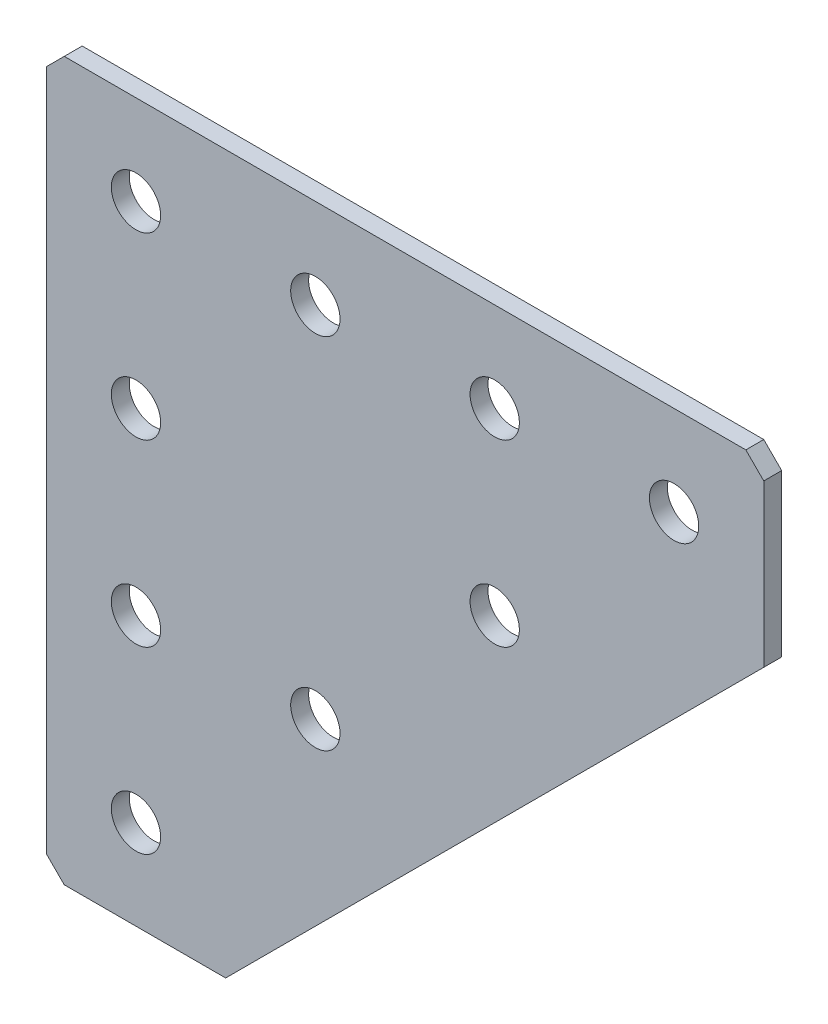
ISO-10303-21;
HEADER;
FILE_DESCRIPTION(('STEP AP214'),'2;1');
FILE_NAME('part.step','',(''),(''),'','','');
FILE_SCHEMA(('AUTOMOTIVE_DESIGN { 1 0 10303 214 1 1 1 1 }'));
ENDSEC;
DATA;
#1=APPLICATION_CONTEXT('core data for automotive mechanical design processes');
#2=APPLICATION_PROTOCOL_DEFINITION('international standard','automotive_design',2000,#1);
#3=PRODUCT_CONTEXT('',#1,'mechanical');
#4=PRODUCT('Part','Part','',(#3));
#5=PRODUCT_RELATED_PRODUCT_CATEGORY('part','',(#4));
#6=PRODUCT_DEFINITION_FORMATION('','',#4);
#7=PRODUCT_DEFINITION_CONTEXT('part definition',#1,'design');
#8=PRODUCT_DEFINITION('design','',#6,#7);
#9=PRODUCT_DEFINITION_SHAPE('','',#8);
#10=(LENGTH_UNIT() NAMED_UNIT(*) SI_UNIT(.MILLI.,.METRE.));
#11=(NAMED_UNIT(*) PLANE_ANGLE_UNIT() SI_UNIT($,.RADIAN.));
#12=(NAMED_UNIT(*) SI_UNIT($,.STERADIAN.) SOLID_ANGLE_UNIT());
#13=UNCERTAINTY_MEASURE_WITH_UNIT(LENGTH_MEASURE(1.E-05),#10,'distance_accuracy_value','');
#14=(GEOMETRIC_REPRESENTATION_CONTEXT(3) GLOBAL_UNCERTAINTY_ASSIGNED_CONTEXT((#13)) GLOBAL_UNIT_ASSIGNED_CONTEXT((#10,
#11,#12)) REPRESENTATION_CONTEXT('',''));
#15=CARTESIAN_POINT('',(0.,0.,0.));
#16=DIRECTION('',(0.,0.,1.));
#17=DIRECTION('',(1.,0.,0.));
#18=AXIS2_PLACEMENT_3D('',#15,#16,#17);
#19=CARTESIAN_POINT('',(0.,0.,-2.));
#20=DIRECTION('',(0.,-1.,0.));
#21=DIRECTION('',(0.,0.,-1.));
#22=AXIS2_PLACEMENT_3D('',#19,#20,#21);
#23=PLANE('',#22);
#24=DIRECTION('',(1.,0.,0.));
#25=VECTOR('',#24,1.);
#26=CARTESIAN_POINT('',(0.,0.,0.));
#27=LINE('',#26,#25);
#28=CARTESIAN_POINT('',(2.00000000000002,0.,0.));
#29=VERTEX_POINT('',#28);
#30=CARTESIAN_POINT('',(20.,0.,0.));
#31=VERTEX_POINT('',#30);
#32=EDGE_CURVE('E148',#29,#31,#27,.T.);
#33=ORIENTED_EDGE('',*,*,#32,.F.);
#34=DIRECTION('',(0.,0.,-1.));
#35=VECTOR('',#34,1.);
#36=CARTESIAN_POINT('',(2.00000000000002,0.,-2.));
#37=LINE('',#36,#35);
#38=CARTESIAN_POINT('',(2.00000000000002,0.,-2.));
#39=VERTEX_POINT('',#38);
#40=EDGE_CURVE('E117',#29,#39,#37,.T.);
#41=ORIENTED_EDGE('',*,*,#40,.T.);
#42=DIRECTION('',(1.,0.,0.));
#43=VECTOR('',#42,1.);
#44=CARTESIAN_POINT('',(0.,0.,-2.));
#45=LINE('',#44,#43);
#46=CARTESIAN_POINT('',(20.,0.,-2.));
#47=VERTEX_POINT('',#46);
#48=EDGE_CURVE('E111',#39,#47,#45,.T.);
#49=ORIENTED_EDGE('',*,*,#48,.T.);
#50=DIRECTION('',(0.,0.,1.));
#51=VECTOR('',#50,1.);
#52=CARTESIAN_POINT('',(20.,0.,-2.));
#53=LINE('',#52,#51);
#54=EDGE_CURVE('E114',#47,#31,#53,.T.);
#55=ORIENTED_EDGE('',*,*,#54,.T.);
#56=EDGE_LOOP('',(#33,#41,#49,#55));
#57=FACE_BOUND('',#56,.T.);
#58=ADVANCED_FACE('F43',(#57),#23,.T.);
#59=CARTESIAN_POINT('',(0.,0.,-2.));
#60=DIRECTION('',(-1.,0.,0.));
#61=DIRECTION('',(0.,0.,1.));
#62=AXIS2_PLACEMENT_3D('',#59,#60,#61);
#63=PLANE('',#62);
#64=DIRECTION('',(0.,-1.,0.));
#65=VECTOR('',#64,1.);
#66=CARTESIAN_POINT('',(0.,0.,-2.));
#67=LINE('',#66,#65);
#68=CARTESIAN_POINT('',(0.,78.,-2.));
#69=VERTEX_POINT('',#68);
#70=CARTESIAN_POINT('',(0.,2.,-2.));
#71=VERTEX_POINT('',#70);
#72=EDGE_CURVE('E131',#69,#71,#67,.T.);
#73=ORIENTED_EDGE('',*,*,#72,.T.);
#74=DIRECTION('',(0.,0.,1.));
#75=VECTOR('',#74,1.);
#76=CARTESIAN_POINT('',(0.,2.,-2.));
#77=LINE('',#76,#75);
#78=CARTESIAN_POINT('',(0.,2.,0.));
#79=VERTEX_POINT('',#78);
#80=EDGE_CURVE('E176',#71,#79,#77,.T.);
#81=ORIENTED_EDGE('',*,*,#80,.T.);
#82=DIRECTION('',(0.,-1.,0.));
#83=VECTOR('',#82,1.);
#84=CARTESIAN_POINT('',(0.,0.,0.));
#85=LINE('',#84,#83);
#86=CARTESIAN_POINT('',(0.,78.,0.));
#87=VERTEX_POINT('',#86);
#88=EDGE_CURVE('E122',#87,#79,#85,.T.);
#89=ORIENTED_EDGE('',*,*,#88,.F.);
#90=DIRECTION('',(0.,0.,-1.));
#91=VECTOR('',#90,1.);
#92=CARTESIAN_POINT('',(0.,78.,-2.));
#93=LINE('',#92,#91);
#94=EDGE_CURVE('E166',#87,#69,#93,.T.);
#95=ORIENTED_EDGE('',*,*,#94,.T.);
#96=EDGE_LOOP('',(#73,#81,#89,#95));
#97=FACE_BOUND('',#96,.T.);
#98=ADVANCED_FACE('F221',(#97),#63,.T.);
#99=CARTESIAN_POINT('',(0.,80.,-2.));
#100=DIRECTION('',(0.,1.,0.));
#101=DIRECTION('',(0.,0.,1.));
#102=AXIS2_PLACEMENT_3D('',#99,#100,#101);
#103=PLANE('',#102);
#104=DIRECTION('',(-1.,0.,0.));
#105=VECTOR('',#104,1.);
#106=CARTESIAN_POINT('',(0.,80.,-2.));
#107=LINE('',#106,#105);
#108=CARTESIAN_POINT('',(78.,80.,-2.));
#109=VERTEX_POINT('',#108);
#110=CARTESIAN_POINT('',(2.,80.,-2.));
#111=VERTEX_POINT('',#110);
#112=EDGE_CURVE('E139',#109,#111,#107,.T.);
#113=ORIENTED_EDGE('',*,*,#112,.T.);
#114=DIRECTION('',(0.,0.,1.));
#115=VECTOR('',#114,1.);
#116=CARTESIAN_POINT('',(2.,80.,-2.));
#117=LINE('',#116,#115);
#118=CARTESIAN_POINT('',(2.,80.,0.));
#119=VERTEX_POINT('',#118);
#120=EDGE_CURVE('E52',#111,#119,#117,.T.);
#121=ORIENTED_EDGE('',*,*,#120,.T.);
#122=DIRECTION('',(-1.,0.,0.));
#123=VECTOR('',#122,1.);
#124=CARTESIAN_POINT('',(0.,80.,0.));
#125=LINE('',#124,#123);
#126=CARTESIAN_POINT('',(78.,80.,0.));
#127=VERTEX_POINT('',#126);
#128=EDGE_CURVE('E158',#127,#119,#125,.T.);
#129=ORIENTED_EDGE('',*,*,#128,.F.);
#130=DIRECTION('',(0.,0.,-1.));
#131=VECTOR('',#130,1.);
#132=CARTESIAN_POINT('',(78.,80.,-2.));
#133=LINE('',#132,#131);
#134=EDGE_CURVE('E198',#127,#109,#133,.T.);
#135=ORIENTED_EDGE('',*,*,#134,.T.);
#136=EDGE_LOOP('',(#113,#121,#129,#135));
#137=FACE_BOUND('',#136,.T.);
#138=ADVANCED_FACE('F206',(#137),#103,.T.);
#139=CARTESIAN_POINT('',(80.,80.,-2.));
#140=DIRECTION('',(1.,0.,0.));
#141=DIRECTION('',(0.,0.,-1.));
#142=AXIS2_PLACEMENT_3D('',#139,#140,#141);
#143=PLANE('',#142);
#144=DIRECTION('',(0.,1.,0.));
#145=VECTOR('',#144,1.);
#146=CARTESIAN_POINT('',(80.,80.,-2.));
#147=LINE('',#146,#145);
#148=CARTESIAN_POINT('',(80.,60.,-2.));
#149=VERTEX_POINT('',#148);
#150=CARTESIAN_POINT('',(80.,78.,-2.));
#151=VERTEX_POINT('',#150);
#152=EDGE_CURVE('E134',#149,#151,#147,.T.);
#153=ORIENTED_EDGE('',*,*,#152,.T.);
#154=DIRECTION('',(0.,0.,1.));
#155=VECTOR('',#154,1.);
#156=CARTESIAN_POINT('',(80.,78.,-2.));
#157=LINE('',#156,#155);
#158=CARTESIAN_POINT('',(80.,78.,0.));
#159=VERTEX_POINT('',#158);
#160=EDGE_CURVE('E11',#151,#159,#157,.T.);
#161=ORIENTED_EDGE('',*,*,#160,.T.);
#162=DIRECTION('',(0.,1.,0.));
#163=VECTOR('',#162,1.);
#164=CARTESIAN_POINT('',(80.,80.,0.));
#165=LINE('',#164,#163);
#166=CARTESIAN_POINT('',(80.,60.,0.));
#167=VERTEX_POINT('',#166);
#168=EDGE_CURVE('E154',#167,#159,#165,.T.);
#169=ORIENTED_EDGE('',*,*,#168,.F.);
#170=DIRECTION('',(0.,0.,1.));
#171=VECTOR('',#170,1.);
#172=CARTESIAN_POINT('',(80.,60.,-2.));
#173=LINE('',#172,#171);
#174=EDGE_CURVE('E130',#149,#167,#173,.T.);
#175=ORIENTED_EDGE('',*,*,#174,.F.);
#176=EDGE_LOOP('',(#153,#161,#169,#175));
#177=FACE_BOUND('',#176,.T.);
#178=ADVANCED_FACE('F216',(#177),#143,.T.);
#179=CARTESIAN_POINT('',(80.,60.,-2.));
#180=DIRECTION('',(0.707106781186547,-0.707106781186547,0.));
#181=DIRECTION('',(0.707106781186548,0.707106781186548,0.));
#182=AXIS2_PLACEMENT_3D('',#179,#180,#181);
#183=PLANE('',#182);
#184=DIRECTION('',(0.707106781186547,0.707106781186547,0.));
#185=VECTOR('',#184,1.);
#186=CARTESIAN_POINT('',(80.,60.,0.));
#187=LINE('',#186,#185);
#188=EDGE_CURVE('E128',#31,#167,#187,.T.);
#189=ORIENTED_EDGE('',*,*,#188,.F.);
#190=ORIENTED_EDGE('',*,*,#54,.F.);
#191=DIRECTION('',(0.707106781186547,0.707106781186547,0.));
#192=VECTOR('',#191,1.);
#193=CARTESIAN_POINT('',(80.,60.,-2.));
#194=LINE('',#193,#192);
#195=EDGE_CURVE('E121',#47,#149,#194,.T.);
#196=ORIENTED_EDGE('',*,*,#195,.T.);
#197=ORIENTED_EDGE('',*,*,#174,.T.);
#198=EDGE_LOOP('',(#189,#190,#196,#197));
#199=FACE_BOUND('',#198,.T.);
#200=ADVANCED_FACE('F126',(#199),#183,.T.);
#201=CARTESIAN_POINT('',(0.,0.,-2.));
#202=DIRECTION('',(0.,0.,-1.));
#203=DIRECTION('',(-1.,0.,0.));
#204=AXIS2_PLACEMENT_3D('',#201,#202,#203);
#205=PLANE('',#204);
#206=CARTESIAN_POINT('',(10.,30.,-2.));
#207=DIRECTION('',(0.,0.,-1.));
#208=DIRECTION('',(-1.,0.,0.));
#209=AXIS2_PLACEMENT_3D('',#206,#207,#208);
#210=CIRCLE('',#209,2.75);
#211=CARTESIAN_POINT('',(7.25,30.,-2.));
#212=VERTEX_POINT('',#211);
#213=EDGE_CURVE('E289',#212,#212,#210,.T.);
#214=ORIENTED_EDGE('',*,*,#213,.F.);
#215=EDGE_LOOP('',(#214));
#216=FACE_BOUND('',#215,.T.);
#217=CARTESIAN_POINT('',(50.,70.,-2.));
#218=DIRECTION('',(0.,0.,-1.));
#219=DIRECTION('',(-1.,0.,0.));
#220=AXIS2_PLACEMENT_3D('',#217,#218,#219);
#221=CIRCLE('',#220,2.75);
#222=CARTESIAN_POINT('',(47.25,70.,-2.));
#223=VERTEX_POINT('',#222);
#224=EDGE_CURVE('E303',#223,#223,#221,.T.);
#225=ORIENTED_EDGE('',*,*,#224,.F.);
#226=EDGE_LOOP('',(#225));
#227=FACE_BOUND('',#226,.T.);
#228=CARTESIAN_POINT('',(70.,70.,-2.));
#229=DIRECTION('',(0.,0.,-1.));
#230=DIRECTION('',(-1.,0.,0.));
#231=AXIS2_PLACEMENT_3D('',#228,#229,#230);
#232=CIRCLE('',#231,2.75);
#233=CARTESIAN_POINT('',(67.25,70.,-2.));
#234=VERTEX_POINT('',#233);
#235=EDGE_CURVE('E311',#234,#234,#232,.T.);
#236=ORIENTED_EDGE('',*,*,#235,.F.);
#237=EDGE_LOOP('',(#236));
#238=FACE_BOUND('',#237,.T.);
#239=CARTESIAN_POINT('',(30.,70.,-2.));
#240=DIRECTION('',(0.,0.,-1.));
#241=DIRECTION('',(-1.,0.,0.));
#242=AXIS2_PLACEMENT_3D('',#239,#240,#241);
#243=CIRCLE('',#242,2.75);
#244=CARTESIAN_POINT('',(27.25,70.,-2.));
#245=VERTEX_POINT('',#244);
#246=EDGE_CURVE('E319',#245,#245,#243,.T.);
#247=ORIENTED_EDGE('',*,*,#246,.F.);
#248=EDGE_LOOP('',(#247));
#249=FACE_BOUND('',#248,.T.);
#250=CARTESIAN_POINT('',(10.,70.,-2.));
#251=DIRECTION('',(0.,0.,-1.));
#252=DIRECTION('',(-1.,0.,0.));
#253=AXIS2_PLACEMENT_3D('',#250,#251,#252);
#254=CIRCLE('',#253,2.75);
#255=CARTESIAN_POINT('',(7.25,70.,-2.));
#256=VERTEX_POINT('',#255);
#257=EDGE_CURVE('E168',#256,#256,#254,.T.);
#258=ORIENTED_EDGE('',*,*,#257,.F.);
#259=EDGE_LOOP('',(#258));
#260=FACE_BOUND('',#259,.T.);
#261=CARTESIAN_POINT('',(10.,9.99999999999999,-2.));
#262=DIRECTION('',(0.,0.,-1.));
#263=DIRECTION('',(-1.,0.,0.));
#264=AXIS2_PLACEMENT_3D('',#261,#262,#263);
#265=CIRCLE('',#264,2.75);
#266=CARTESIAN_POINT('',(7.25000000000001,9.99999999999999,-2.));
#267=VERTEX_POINT('',#266);
#268=EDGE_CURVE('E329',#267,#267,#265,.T.);
#269=ORIENTED_EDGE('',*,*,#268,.F.);
#270=EDGE_LOOP('',(#269));
#271=FACE_BOUND('',#270,.T.);
#272=CARTESIAN_POINT('',(10.,50.,-2.));
#273=DIRECTION('',(0.,0.,-1.));
#274=DIRECTION('',(-1.,0.,0.));
#275=AXIS2_PLACEMENT_3D('',#272,#273,#274);
#276=CIRCLE('',#275,2.75);
#277=CARTESIAN_POINT('',(7.25,50.,-2.));
#278=VERTEX_POINT('',#277);
#279=EDGE_CURVE('E337',#278,#278,#276,.T.);
#280=ORIENTED_EDGE('',*,*,#279,.F.);
#281=EDGE_LOOP('',(#280));
#282=FACE_BOUND('',#281,.T.);
#283=CARTESIAN_POINT('',(30.,30.,-2.));
#284=DIRECTION('',(0.,0.,-1.));
#285=DIRECTION('',(-1.,0.,0.));
#286=AXIS2_PLACEMENT_3D('',#283,#284,#285);
#287=CIRCLE('',#286,2.75);
#288=CARTESIAN_POINT('',(27.25,30.,-2.));
#289=VERTEX_POINT('',#288);
#290=EDGE_CURVE('E345',#289,#289,#287,.T.);
#291=ORIENTED_EDGE('',*,*,#290,.F.);
#292=EDGE_LOOP('',(#291));
#293=FACE_BOUND('',#292,.T.);
#294=CARTESIAN_POINT('',(50.,50.,-2.));
#295=DIRECTION('',(0.,0.,-1.));
#296=DIRECTION('',(-1.,0.,0.));
#297=AXIS2_PLACEMENT_3D('',#294,#295,#296);
#298=CIRCLE('',#297,2.75);
#299=CARTESIAN_POINT('',(47.25,50.,-2.));
#300=VERTEX_POINT('',#299);
#301=EDGE_CURVE('E151',#300,#300,#298,.T.);
#302=ORIENTED_EDGE('',*,*,#301,.F.);
#303=EDGE_LOOP('',(#302));
#304=FACE_BOUND('',#303,.T.);
#305=ORIENTED_EDGE('',*,*,#48,.F.);
#306=DIRECTION('',(0.70710678118655,-0.707106781186545,0.));
#307=VECTOR('',#306,1.);
#308=CARTESIAN_POINT('',(1.,1.00000000000001,-2.));
#309=LINE('',#308,#307);
#310=EDGE_CURVE('E195',#39,#71,#309,.F.);
#311=ORIENTED_EDGE('',*,*,#310,.T.);
#312=ORIENTED_EDGE('',*,*,#72,.F.);
#313=DIRECTION('',(-0.707106781186545,-0.70710678118655,0.));
#314=VECTOR('',#313,1.);
#315=CARTESIAN_POINT('',(-39.,38.9999999999997,-2.));
#316=LINE('',#315,#314);
#317=EDGE_CURVE('E65',#69,#111,#316,.F.);
#318=ORIENTED_EDGE('',*,*,#317,.T.);
#319=ORIENTED_EDGE('',*,*,#112,.F.);
#320=DIRECTION('',(-0.70710678118655,0.707106781186545,0.));
#321=VECTOR('',#320,1.);
#322=CARTESIAN_POINT('',(78.9999999999997,79.0000000000003,-2.));
#323=LINE('',#322,#321);
#324=EDGE_CURVE('E59',#109,#151,#323,.F.);
#325=ORIENTED_EDGE('',*,*,#324,.T.);
#326=ORIENTED_EDGE('',*,*,#152,.F.);
#327=ORIENTED_EDGE('',*,*,#195,.F.);
#328=EDGE_LOOP('',(#305,#311,#312,#318,#319,#325,#326,#327));
#329=FACE_BOUND('',#328,.T.);
#330=ADVANCED_FACE('F133',(#216,#227,#238,#249,#260,#271,#282,#293,#304,#329),#205,.T.);
#331=CARTESIAN_POINT('',(0.,0.,0.));
#332=DIRECTION('',(0.,0.,-1.));
#333=DIRECTION('',(-1.,0.,0.));
#334=AXIS2_PLACEMENT_3D('',#331,#332,#333);
#335=PLANE('',#334);
#336=CARTESIAN_POINT('',(10.,30.,0.));
#337=DIRECTION('',(0.,0.,1.));
#338=DIRECTION('',(1.,0.,0.));
#339=AXIS2_PLACEMENT_3D('',#336,#337,#338);
#340=CIRCLE('',#339,2.75);
#341=CARTESIAN_POINT('',(12.75,30.,0.));
#342=VERTEX_POINT('',#341);
#343=EDGE_CURVE('E292',#342,#342,#340,.T.);
#344=ORIENTED_EDGE('',*,*,#343,.F.);
#345=EDGE_LOOP('',(#344));
#346=FACE_BOUND('',#345,.T.);
#347=CARTESIAN_POINT('',(50.,70.,0.));
#348=DIRECTION('',(0.,0.,1.));
#349=DIRECTION('',(1.,0.,0.));
#350=AXIS2_PLACEMENT_3D('',#347,#348,#349);
#351=CIRCLE('',#350,2.75);
#352=CARTESIAN_POINT('',(52.75,70.,0.));
#353=VERTEX_POINT('',#352);
#354=EDGE_CURVE('E297',#353,#353,#351,.T.);
#355=ORIENTED_EDGE('',*,*,#354,.F.);
#356=EDGE_LOOP('',(#355));
#357=FACE_BOUND('',#356,.T.);
#358=CARTESIAN_POINT('',(70.,70.,0.));
#359=DIRECTION('',(0.,0.,1.));
#360=DIRECTION('',(1.,0.,0.));
#361=AXIS2_PLACEMENT_3D('',#358,#359,#360);
#362=CIRCLE('',#361,2.75);
#363=CARTESIAN_POINT('',(72.75,70.,0.));
#364=VERTEX_POINT('',#363);
#365=EDGE_CURVE('E307',#364,#364,#362,.T.);
#366=ORIENTED_EDGE('',*,*,#365,.F.);
#367=EDGE_LOOP('',(#366));
#368=FACE_BOUND('',#367,.T.);
#369=CARTESIAN_POINT('',(30.,70.,0.));
#370=DIRECTION('',(0.,0.,1.));
#371=DIRECTION('',(1.,0.,0.));
#372=AXIS2_PLACEMENT_3D('',#369,#370,#371);
#373=CIRCLE('',#372,2.75);
#374=CARTESIAN_POINT('',(32.75,70.,0.));
#375=VERTEX_POINT('',#374);
#376=EDGE_CURVE('E315',#375,#375,#373,.T.);
#377=ORIENTED_EDGE('',*,*,#376,.F.);
#378=EDGE_LOOP('',(#377));
#379=FACE_BOUND('',#378,.T.);
#380=CARTESIAN_POINT('',(10.,70.,0.));
#381=DIRECTION('',(0.,0.,1.));
#382=DIRECTION('',(1.,0.,0.));
#383=AXIS2_PLACEMENT_3D('',#380,#381,#382);
#384=CIRCLE('',#383,2.75);
#385=CARTESIAN_POINT('',(12.75,70.,0.));
#386=VERTEX_POINT('',#385);
#387=EDGE_CURVE('E173',#386,#386,#384,.T.);
#388=ORIENTED_EDGE('',*,*,#387,.F.);
#389=EDGE_LOOP('',(#388));
#390=FACE_BOUND('',#389,.T.);
#391=CARTESIAN_POINT('',(10.,9.99999999999999,0.));
#392=DIRECTION('',(0.,0.,1.));
#393=DIRECTION('',(1.,0.,0.));
#394=AXIS2_PLACEMENT_3D('',#391,#392,#393);
#395=CIRCLE('',#394,2.75);
#396=CARTESIAN_POINT('',(12.75,9.99999999999999,0.));
#397=VERTEX_POINT('',#396);
#398=EDGE_CURVE('E172',#397,#397,#395,.T.);
#399=ORIENTED_EDGE('',*,*,#398,.F.);
#400=EDGE_LOOP('',(#399));
#401=FACE_BOUND('',#400,.T.);
#402=CARTESIAN_POINT('',(10.,50.,0.));
#403=DIRECTION('',(0.,0.,1.));
#404=DIRECTION('',(1.,0.,0.));
#405=AXIS2_PLACEMENT_3D('',#402,#403,#404);
#406=CIRCLE('',#405,2.75);
#407=CARTESIAN_POINT('',(12.75,50.,0.));
#408=VERTEX_POINT('',#407);
#409=EDGE_CURVE('E333',#408,#408,#406,.T.);
#410=ORIENTED_EDGE('',*,*,#409,.F.);
#411=EDGE_LOOP('',(#410));
#412=FACE_BOUND('',#411,.T.);
#413=CARTESIAN_POINT('',(30.,30.,0.));
#414=DIRECTION('',(0.,0.,1.));
#415=DIRECTION('',(1.,0.,0.));
#416=AXIS2_PLACEMENT_3D('',#413,#414,#415);
#417=CIRCLE('',#416,2.75);
#418=CARTESIAN_POINT('',(32.75,30.,0.));
#419=VERTEX_POINT('',#418);
#420=EDGE_CURVE('E341',#419,#419,#417,.T.);
#421=ORIENTED_EDGE('',*,*,#420,.F.);
#422=EDGE_LOOP('',(#421));
#423=FACE_BOUND('',#422,.T.);
#424=CARTESIAN_POINT('',(50.,50.,0.));
#425=DIRECTION('',(0.,0.,1.));
#426=DIRECTION('',(1.,0.,0.));
#427=AXIS2_PLACEMENT_3D('',#424,#425,#426);
#428=CIRCLE('',#427,2.75);
#429=CARTESIAN_POINT('',(52.75,50.,0.));
#430=VERTEX_POINT('',#429);
#431=EDGE_CURVE('E349',#430,#430,#428,.T.);
#432=ORIENTED_EDGE('',*,*,#431,.F.);
#433=EDGE_LOOP('',(#432));
#434=FACE_BOUND('',#433,.T.);
#435=ORIENTED_EDGE('',*,*,#88,.T.);
#436=DIRECTION('',(-0.70710678118655,0.707106781186545,0.));
#437=VECTOR('',#436,1.);
#438=CARTESIAN_POINT('',(0.,2.,0.));
#439=LINE('',#438,#437);
#440=EDGE_CURVE('E186',#79,#29,#439,.F.);
#441=ORIENTED_EDGE('',*,*,#440,.T.);
#442=ORIENTED_EDGE('',*,*,#32,.T.);
#443=ORIENTED_EDGE('',*,*,#188,.T.);
#444=ORIENTED_EDGE('',*,*,#168,.T.);
#445=DIRECTION('',(0.70710678118655,-0.707106781186545,0.));
#446=VECTOR('',#445,1.);
#447=CARTESIAN_POINT('',(80.,78.,0.));
#448=LINE('',#447,#446);
#449=EDGE_CURVE('E180',#159,#127,#448,.F.);
#450=ORIENTED_EDGE('',*,*,#449,.T.);
#451=ORIENTED_EDGE('',*,*,#128,.T.);
#452=DIRECTION('',(0.707106781186545,0.70710678118655,0.));
#453=VECTOR('',#452,1.);
#454=CARTESIAN_POINT('',(2.,80.,0.));
#455=LINE('',#454,#453);
#456=EDGE_CURVE('E183',#119,#87,#455,.F.);
#457=ORIENTED_EDGE('',*,*,#456,.T.);
#458=EDGE_LOOP('',(#435,#441,#442,#443,#444,#450,#451,#457));
#459=FACE_BOUND('',#458,.T.);
#460=ADVANCED_FACE('F210',(#346,#357,#368,#379,#390,#401,#412,#423,#434,#459),#335,.F.);
#461=CARTESIAN_POINT('',(50.,50.,0.));
#462=DIRECTION('',(0.,0.,1.));
#463=DIRECTION('',(1.,0.,0.));
#464=AXIS2_PLACEMENT_3D('',#461,#462,#463);
#465=CYLINDRICAL_SURFACE('',#464,2.75);
#466=ORIENTED_EDGE('',*,*,#301,.T.);
#467=EDGE_LOOP('',(#466));
#468=FACE_BOUND('',#467,.T.);
#469=ORIENTED_EDGE('',*,*,#431,.T.);
#470=EDGE_LOOP('',(#469));
#471=FACE_BOUND('',#470,.T.);
#472=ADVANCED_FACE('F246',(#468,#471),#465,.F.);
#473=CARTESIAN_POINT('',(30.,30.,0.));
#474=DIRECTION('',(0.,0.,1.));
#475=DIRECTION('',(1.,0.,0.));
#476=AXIS2_PLACEMENT_3D('',#473,#474,#475);
#477=CYLINDRICAL_SURFACE('',#476,2.75);
#478=ORIENTED_EDGE('',*,*,#290,.T.);
#479=EDGE_LOOP('',(#478));
#480=FACE_BOUND('',#479,.T.);
#481=ORIENTED_EDGE('',*,*,#420,.T.);
#482=EDGE_LOOP('',(#481));
#483=FACE_BOUND('',#482,.T.);
#484=ADVANCED_FACE('F253',(#480,#483),#477,.F.);
#485=CARTESIAN_POINT('',(10.,50.,0.));
#486=DIRECTION('',(0.,0.,1.));
#487=DIRECTION('',(1.,0.,0.));
#488=AXIS2_PLACEMENT_3D('',#485,#486,#487);
#489=CYLINDRICAL_SURFACE('',#488,2.75);
#490=ORIENTED_EDGE('',*,*,#279,.T.);
#491=EDGE_LOOP('',(#490));
#492=FACE_BOUND('',#491,.T.);
#493=ORIENTED_EDGE('',*,*,#409,.T.);
#494=EDGE_LOOP('',(#493));
#495=FACE_BOUND('',#494,.T.);
#496=ADVANCED_FACE('F257',(#492,#495),#489,.F.);
#497=CARTESIAN_POINT('',(10.,9.99999999999999,0.));
#498=DIRECTION('',(0.,0.,1.));
#499=DIRECTION('',(1.,0.,0.));
#500=AXIS2_PLACEMENT_3D('',#497,#498,#499);
#501=CYLINDRICAL_SURFACE('',#500,2.75);
#502=ORIENTED_EDGE('',*,*,#268,.T.);
#503=EDGE_LOOP('',(#502));
#504=FACE_BOUND('',#503,.T.);
#505=ORIENTED_EDGE('',*,*,#398,.T.);
#506=EDGE_LOOP('',(#505));
#507=FACE_BOUND('',#506,.T.);
#508=ADVANCED_FACE('F261',(#504,#507),#501,.F.);
#509=CARTESIAN_POINT('',(10.,70.,0.));
#510=DIRECTION('',(0.,0.,1.));
#511=DIRECTION('',(1.,0.,0.));
#512=AXIS2_PLACEMENT_3D('',#509,#510,#511);
#513=CYLINDRICAL_SURFACE('',#512,2.75);
#514=ORIENTED_EDGE('',*,*,#257,.T.);
#515=EDGE_LOOP('',(#514));
#516=FACE_BOUND('',#515,.T.);
#517=ORIENTED_EDGE('',*,*,#387,.T.);
#518=EDGE_LOOP('',(#517));
#519=FACE_BOUND('',#518,.T.);
#520=ADVANCED_FACE('F265',(#516,#519),#513,.F.);
#521=CARTESIAN_POINT('',(30.,70.,0.));
#522=DIRECTION('',(0.,0.,1.));
#523=DIRECTION('',(1.,0.,0.));
#524=AXIS2_PLACEMENT_3D('',#521,#522,#523);
#525=CYLINDRICAL_SURFACE('',#524,2.75);
#526=ORIENTED_EDGE('',*,*,#246,.T.);
#527=EDGE_LOOP('',(#526));
#528=FACE_BOUND('',#527,.T.);
#529=ORIENTED_EDGE('',*,*,#376,.T.);
#530=EDGE_LOOP('',(#529));
#531=FACE_BOUND('',#530,.T.);
#532=ADVANCED_FACE('F269',(#528,#531),#525,.F.);
#533=CARTESIAN_POINT('',(70.,70.,0.));
#534=DIRECTION('',(0.,0.,1.));
#535=DIRECTION('',(1.,0.,0.));
#536=AXIS2_PLACEMENT_3D('',#533,#534,#535);
#537=CYLINDRICAL_SURFACE('',#536,2.75);
#538=ORIENTED_EDGE('',*,*,#235,.T.);
#539=EDGE_LOOP('',(#538));
#540=FACE_BOUND('',#539,.T.);
#541=ORIENTED_EDGE('',*,*,#365,.T.);
#542=EDGE_LOOP('',(#541));
#543=FACE_BOUND('',#542,.T.);
#544=ADVANCED_FACE('F273',(#540,#543),#537,.F.);
#545=CARTESIAN_POINT('',(50.,70.,0.));
#546=DIRECTION('',(0.,0.,1.));
#547=DIRECTION('',(1.,0.,0.));
#548=AXIS2_PLACEMENT_3D('',#545,#546,#547);
#549=CYLINDRICAL_SURFACE('',#548,2.75);
#550=ORIENTED_EDGE('',*,*,#224,.T.);
#551=EDGE_LOOP('',(#550));
#552=FACE_BOUND('',#551,.T.);
#553=ORIENTED_EDGE('',*,*,#354,.T.);
#554=EDGE_LOOP('',(#553));
#555=FACE_BOUND('',#554,.T.);
#556=ADVANCED_FACE('F277',(#552,#555),#549,.F.);
#557=CARTESIAN_POINT('',(10.,30.,0.));
#558=DIRECTION('',(0.,0.,1.));
#559=DIRECTION('',(1.,0.,0.));
#560=AXIS2_PLACEMENT_3D('',#557,#558,#559);
#561=CYLINDRICAL_SURFACE('',#560,2.75);
#562=ORIENTED_EDGE('',*,*,#213,.T.);
#563=EDGE_LOOP('',(#562));
#564=FACE_BOUND('',#563,.T.);
#565=ORIENTED_EDGE('',*,*,#343,.T.);
#566=EDGE_LOOP('',(#565));
#567=FACE_BOUND('',#566,.T.);
#568=ADVANCED_FACE('F229',(#564,#567),#561,.F.);
#569=CARTESIAN_POINT('',(0.,2.,-2.));
#570=DIRECTION('',(0.707106781186545,0.70710678118655,0.));
#571=DIRECTION('',(0.,0.,1.));
#572=AXIS2_PLACEMENT_3D('',#569,#570,#571);
#573=PLANE('',#572);
#574=ORIENTED_EDGE('',*,*,#310,.F.);
#575=ORIENTED_EDGE('',*,*,#40,.F.);
#576=ORIENTED_EDGE('',*,*,#440,.F.);
#577=ORIENTED_EDGE('',*,*,#80,.F.);
#578=EDGE_LOOP('',(#574,#575,#576,#577));
#579=FACE_BOUND('',#578,.T.);
#580=ADVANCED_FACE('F218',(#579),#573,.F.);
#581=CARTESIAN_POINT('',(2.,80.,-2.));
#582=DIRECTION('',(0.70710678118655,-0.707106781186545,0.));
#583=DIRECTION('',(0.,0.,1.));
#584=AXIS2_PLACEMENT_3D('',#581,#582,#583);
#585=PLANE('',#584);
#586=ORIENTED_EDGE('',*,*,#317,.F.);
#587=ORIENTED_EDGE('',*,*,#94,.F.);
#588=ORIENTED_EDGE('',*,*,#456,.F.);
#589=ORIENTED_EDGE('',*,*,#120,.F.);
#590=EDGE_LOOP('',(#586,#587,#588,#589));
#591=FACE_BOUND('',#590,.T.);
#592=ADVANCED_FACE('F223',(#591),#585,.F.);
#593=CARTESIAN_POINT('',(80.,78.,-2.));
#594=DIRECTION('',(-0.707106781186545,-0.70710678118655,0.));
#595=DIRECTION('',(0.,0.,1.));
#596=AXIS2_PLACEMENT_3D('',#593,#594,#595);
#597=PLANE('',#596);
#598=ORIENTED_EDGE('',*,*,#324,.F.);
#599=ORIENTED_EDGE('',*,*,#134,.F.);
#600=ORIENTED_EDGE('',*,*,#449,.F.);
#601=ORIENTED_EDGE('',*,*,#160,.F.);
#602=EDGE_LOOP('',(#598,#599,#600,#601));
#603=FACE_BOUND('',#602,.T.);
#604=ADVANCED_FACE('F45',(#603),#597,.F.);
#605=CLOSED_SHELL('',(#58,#98,#138,#178,#200,#330,#460,#472,#484,#496,#508,#520,#532,#544,#556,
#568,#580,#592,#604));
#606=MANIFOLD_SOLID_BREP('B2',#605);
#607=ADVANCED_BREP_SHAPE_REPRESENTATION('',(#18,#606),#14);
#608=SHAPE_DEFINITION_REPRESENTATION(#9,#607);
ENDSEC;
END-ISO-10303-21;
